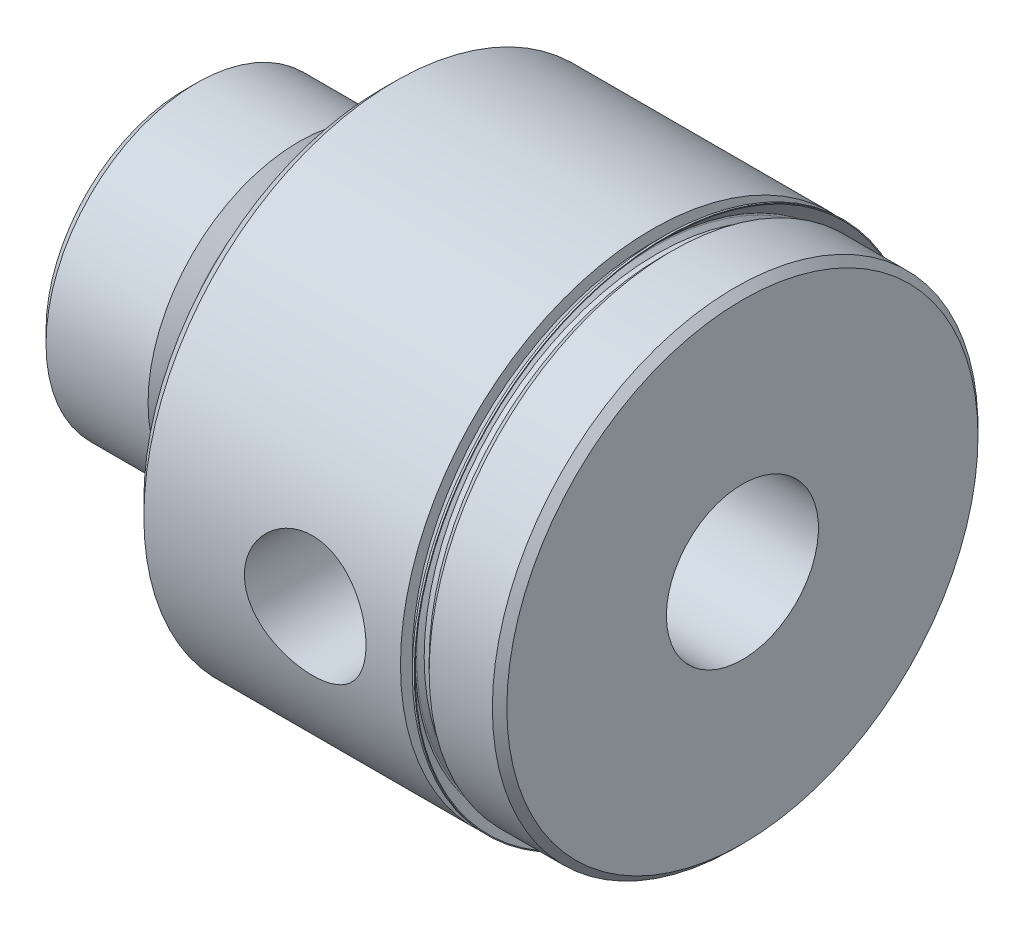
ISO-10303-21;
HEADER;
FILE_DESCRIPTION(('STEP AP214'),'2;1');
FILE_NAME('part.step','',(''),(''),'','','');
FILE_SCHEMA(('AUTOMOTIVE_DESIGN { 1 0 10303 214 1 1 1 1 }'));
ENDSEC;
DATA;
#1=APPLICATION_CONTEXT('core data for automotive mechanical design processes');
#2=APPLICATION_PROTOCOL_DEFINITION('international standard','automotive_design',2000,#1);
#3=PRODUCT_CONTEXT('',#1,'mechanical');
#4=PRODUCT('Part','Part','',(#3));
#5=PRODUCT_RELATED_PRODUCT_CATEGORY('part','',(#4));
#6=PRODUCT_DEFINITION_FORMATION('','',#4);
#7=PRODUCT_DEFINITION_CONTEXT('part definition',#1,'design');
#8=PRODUCT_DEFINITION('design','',#6,#7);
#9=PRODUCT_DEFINITION_SHAPE('','',#8);
#10=(LENGTH_UNIT() NAMED_UNIT(*) SI_UNIT(.MILLI.,.METRE.));
#11=(NAMED_UNIT(*) PLANE_ANGLE_UNIT() SI_UNIT($,.RADIAN.));
#12=(NAMED_UNIT(*) SI_UNIT($,.STERADIAN.) SOLID_ANGLE_UNIT());
#13=UNCERTAINTY_MEASURE_WITH_UNIT(LENGTH_MEASURE(1.E-05),#10,'distance_accuracy_value','');
#14=(GEOMETRIC_REPRESENTATION_CONTEXT(3) GLOBAL_UNCERTAINTY_ASSIGNED_CONTEXT((#13)) GLOBAL_UNIT_ASSIGNED_CONTEXT((#10,
#11,#12)) REPRESENTATION_CONTEXT('',''));
#15=CARTESIAN_POINT('',(0.,0.,0.));
#16=DIRECTION('',(0.,0.,1.));
#17=DIRECTION('',(1.,0.,0.));
#18=AXIS2_PLACEMENT_3D('',#15,#16,#17);
#19=CARTESIAN_POINT('',(49.1998,26.48585,0.));
#20=DIRECTION('',(-1.,0.,0.));
#21=DIRECTION('',(0.,0.,1.));
#22=AXIS2_PLACEMENT_3D('',#19,#20,#21);
#23=PLANE('',#22);
#24=CARTESIAN_POINT('',(49.1998,0.,0.));
#25=DIRECTION('',(-1.,0.,0.));
#26=DIRECTION('',(0.,0.,1.));
#27=AXIS2_PLACEMENT_3D('',#24,#25,#26);
#28=CIRCLE('',#27,26.48585);
#29=CARTESIAN_POINT('',(49.1998,0.,26.48585));
#30=VERTEX_POINT('',#29);
#31=EDGE_CURVE('E119',#30,#30,#28,.T.);
#32=ORIENTED_EDGE('',*,*,#31,.F.);
#33=EDGE_LOOP('',(#32));
#34=FACE_BOUND('',#33,.T.);
#35=CARTESIAN_POINT('',(49.1998,5.4065115745023E-13,2.56788768818364E-13));
#36=DIRECTION('',(-1.,0.,0.));
#37=DIRECTION('',(0.,0.,1.));
#38=AXIS2_PLACEMENT_3D('',#35,#36,#37);
#39=CIRCLE('',#38,25.2413407119712);
#40=CARTESIAN_POINT('',(49.1998,5.4065115745023E-13,25.2413407119715));
#41=VERTEX_POINT('',#40);
#42=EDGE_CURVE('E10',#41,#41,#39,.F.);
#43=ORIENTED_EDGE('',*,*,#42,.F.);
#44=EDGE_LOOP('',(#43));
#45=FACE_BOUND('',#44,.T.);
#46=ADVANCED_FACE('F36',(#34,#45),#23,.F.);
#47=CARTESIAN_POINT('',(58.7248,0.,0.));
#48=DIRECTION('',(-1.,0.,0.));
#49=DIRECTION('',(0.,0.,1.));
#50=AXIS2_PLACEMENT_3D('',#47,#48,#49);
#51=CYLINDRICAL_SURFACE('',#50,24.51735);
#52=CARTESIAN_POINT('',(50.2539,0.,0.));
#53=DIRECTION('',(-1.,0.,0.));
#54=DIRECTION('',(0.,0.,1.));
#55=AXIS2_PLACEMENT_3D('',#52,#53,#54);
#56=CIRCLE('',#55,24.51735);
#57=CARTESIAN_POINT('',(50.2539,0.,24.51735));
#58=VERTEX_POINT('',#57);
#59=EDGE_CURVE('E122',#58,#58,#56,.T.);
#60=ORIENTED_EDGE('',*,*,#59,.T.);
#61=EDGE_LOOP('',(#60));
#62=FACE_BOUND('',#61,.T.);
#63=CARTESIAN_POINT('',(49.7268499999997,5.32973665201552E-13,0.));
#64=DIRECTION('',(-1.,0.,0.));
#65=DIRECTION('',(0.,-1.,0.));
#66=AXIS2_PLACEMENT_3D('',#63,#64,#65);
#67=CIRCLE('',#66,24.51735);
#68=CARTESIAN_POINT('',(49.72685,-24.5173499999995,0.));
#69=VERTEX_POINT('',#68);
#70=EDGE_CURVE('E43',#69,#69,#67,.T.);
#71=ORIENTED_EDGE('',*,*,#70,.F.);
#72=EDGE_LOOP('',(#71));
#73=FACE_BOUND('',#72,.T.);
#74=ADVANCED_FACE('F109',(#62,#73),#51,.T.);
#75=CARTESIAN_POINT('',(58.7248,0.,0.));
#76=DIRECTION('',(-1.,0.,0.));
#77=DIRECTION('',(0.,0.,1.));
#78=AXIS2_PLACEMENT_3D('',#75,#76,#77);
#79=CYLINDRICAL_SURFACE('',#78,26.48585);
#80=CARTESIAN_POINT('',(22.1742,0.,0.));
#81=DIRECTION('',(-1.,0.,0.));
#82=DIRECTION('',(0.,0.,1.));
#83=AXIS2_PLACEMENT_3D('',#80,#81,#82);
#84=CIRCLE('',#83,26.48585);
#85=CARTESIAN_POINT('',(22.1742,0.,26.48585));
#86=VERTEX_POINT('',#85);
#87=EDGE_CURVE('E121',#86,#86,#84,.T.);
#88=ORIENTED_EDGE('',*,*,#87,.F.);
#89=EDGE_LOOP('',(#88));
#90=FACE_BOUND('',#89,.T.);
#91=ORIENTED_EDGE('',*,*,#31,.T.);
#92=EDGE_LOOP('',(#91));
#93=FACE_BOUND('',#92,.T.);
#94=CARTESIAN_POINT('',(34.7886221966734,-4.65327208066596,26.0738817433423));
#95=CARTESIAN_POINT('',(35.0503250137468,-4.89762199091582,26.0302748760618));
#96=CARTESIAN_POINT('',(35.3327201498537,-5.12006334865186,25.9870281951577));
#97=CARTESIAN_POINT('',(35.931400072388,-5.51501431120025,25.9060939335913));
#98=CARTESIAN_POINT('',(36.2477035296218,-5.68749621153623,25.8684094430399));
#99=CARTESIAN_POINT('',(36.9058562200807,-5.97752910885778,25.8029383750753));
#100=CARTESIAN_POINT('',(37.2477235080772,-6.09504084927617,25.7751588745996));
#101=CARTESIAN_POINT('',(37.9470384692883,-6.27117140002288,25.7328773472432));
#102=CARTESIAN_POINT('',(38.3044817703819,-6.3298066270425,25.718371619302));
#103=CARTESIAN_POINT('',(39.0179323713586,-6.38574483962577,25.7045391490489));
#104=CARTESIAN_POINT('',(39.3738495063825,-6.38413384968114,25.7049436269756));
#105=CARTESIAN_POINT('',(40.0802322089738,-6.32232180677634,25.7202154446409));
#106=CARTESIAN_POINT('',(40.4306978334773,-6.26212136614771,25.7350826332265));
#107=CARTESIAN_POINT('',(41.1131158496232,-6.08589564871848,25.7773185851145));
#108=CARTESIAN_POINT('',(41.4452053064262,-5.97037224924918,25.8045748466811));
#109=CARTESIAN_POINT('',(42.0853739137583,-5.68717401278093,25.8684608307174));
#110=CARTESIAN_POINT('',(42.393450061638,-5.51949266693799,25.9050917229558));
#111=CARTESIAN_POINT('',(42.9836495338366,-5.13268030544473,25.9845240264665));
#112=CARTESIAN_POINT('',(43.265117872442,-4.91257258253571,26.0274357486771));
#113=CARTESIAN_POINT('',(43.7875054943333,-4.42869103906106,26.1141196063505));
#114=CARTESIAN_POINT('',(44.0284199651034,-4.16491204339503,26.1578918432431));
#115=CARTESIAN_POINT('',(44.4666958604103,-3.59592222970502,26.2422080477197));
#116=CARTESIAN_POINT('',(44.6632942385423,-3.29011312197602,26.2826887486539));
#117=CARTESIAN_POINT('',(45.0019831272833,-2.64872366180494,26.3550469417978));
#118=CARTESIAN_POINT('',(45.1440799014565,-2.31314673587264,26.3869254224876));
#119=CARTESIAN_POINT('',(45.3673313362396,-1.62731201762056,26.4380101547286));
#120=CARTESIAN_POINT('',(45.4494223422459,-1.27737396757648,26.4574105151626));
#121=CARTESIAN_POINT('',(45.5534992289219,-0.568204922586495,26.4821289567605));
#122=CARTESIAN_POINT('',(45.5754959923833,-0.208975622139844,26.4874495876933));
#123=CARTESIAN_POINT('',(45.5588526593886,0.498575625977604,26.4834595581465));
#124=CARTESIAN_POINT('',(45.5217786410101,0.84693775036406,26.4745267736136));
#125=CARTESIAN_POINT('',(45.3911728201114,1.5322977583545,26.4437143091526));
#126=CARTESIAN_POINT('',(45.2976407134386,1.86929558072608,26.4218345594763));
#127=CARTESIAN_POINT('',(45.0570005679321,2.52300957468984,26.3674508746053));
#128=CARTESIAN_POINT('',(44.9098386985741,2.83970499097547,26.334936268115));
#129=CARTESIAN_POINT('',(44.5663054184986,3.44427335333977,26.2627121310261));
#130=CARTESIAN_POINT('',(44.369926407282,3.73214183811801,26.2230014894216));
#131=CARTESIAN_POINT('',(43.927487617381,4.27905807646867,26.1394061555511));
#132=CARTESIAN_POINT('',(43.680249709531,4.53714049061541,26.0954387643033));
#133=CARTESIAN_POINT('',(43.1461296484478,5.00873283077326,26.0090457210361));
#134=CARTESIAN_POINT('',(42.8592429723669,5.22223766470689,25.9666202456057));
#135=CARTESIAN_POINT('',(42.2486184115351,5.60184026829495,25.8874090176662));
#136=CARTESIAN_POINT('',(41.9243789391362,5.76715325051728,25.8507207041014));
#137=CARTESIAN_POINT('',(41.2517395999003,6.04088437052545,25.7881333535756));
#138=CARTESIAN_POINT('',(40.9033430576365,6.14931031976122,25.7622328353881));
#139=CARTESIAN_POINT('',(40.1983372701119,6.30446292347342,25.724702715276));
#140=CARTESIAN_POINT('',(39.8419571352832,6.35217440633355,25.7128455466545));
#141=CARTESIAN_POINT('',(39.1260686401128,6.38754472284827,25.7040831577162));
#142=CARTESIAN_POINT('',(38.7665606816757,6.37521116137463,25.707176043933));
#143=CARTESIAN_POINT('',(38.0620656837993,6.29176768274102,25.727721174651));
#144=CARTESIAN_POINT('',(37.716932131715,6.22181610724881,25.7448903997622));
#145=CARTESIAN_POINT('',(37.0434420700745,6.02685464231456,25.7912237896667));
#146=CARTESIAN_POINT('',(36.7150867904294,5.90184072303695,25.820388832385));
#147=CARTESIAN_POINT('',(36.0806344921371,5.59889342293915,25.8877741118627));
#148=CARTESIAN_POINT('',(35.7747997587959,5.42043137683454,25.9260839952532));
#149=CARTESIAN_POINT('',(35.1970254444508,5.01598767052723,26.0073556979387));
#150=CARTESIAN_POINT('',(34.9250911001799,4.78999868309355,26.0503182340376));
#151=CARTESIAN_POINT('',(34.4162829528898,4.29059809340729,26.1372644872056));
#152=CARTESIAN_POINT('',(34.1803669118016,4.01620947963079,26.1812488124112));
#153=CARTESIAN_POINT('',(33.757952861539,3.4310307351736,26.2643383623079));
#154=CARTESIAN_POINT('',(33.5714544483147,3.12024090214758,26.3034436268901));
#155=CARTESIAN_POINT('',(33.2539043498174,2.47148866617688,26.3722961651136));
#156=CARTESIAN_POINT('',(33.1227146368941,2.13359644089971,26.4020666862095));
#157=CARTESIAN_POINT('',(32.9194649614649,1.43965400006564,26.4489776012503));
#158=CARTESIAN_POINT('',(32.8473922411686,1.08360771988489,26.4661207201805));
#159=CARTESIAN_POINT('',(32.7660073813492,0.37383779434233,26.485526538165));
#160=CARTESIAN_POINT('',(32.7550441761507,0.0203136092254355,26.4881806614843));
#161=CARTESIAN_POINT('',(32.7918269028153,-0.683506884728561,26.4793676635885));
#162=CARTESIAN_POINT('',(32.8395744701282,-1.03380310337343,26.4679001490005));
#163=CARTESIAN_POINT('',(32.9911684446352,-1.71665918396044,26.4323453455898));
#164=CARTESIAN_POINT('',(33.094300977536,-2.04938682519429,26.4084187622674));
#165=CARTESIAN_POINT('',(33.3529302336874,-2.69274587515541,26.3505916377497));
#166=CARTESIAN_POINT('',(33.5084055046293,-3.00338627311538,26.3166951833549));
#167=CARTESIAN_POINT('',(33.8392847421248,-3.54880184234715,26.2482350378784));
#168=CARTESIAN_POINT('',(34.007862234018,-3.78787231802198,26.2145894971769));
#169=CARTESIAN_POINT('',(34.3759204274235,-4.2405681658599,26.1451769682063));
#170=CARTESIAN_POINT('',(34.5754035922491,-4.45419150737561,26.1094098109758));
#171=CARTESIAN_POINT('',(34.7886221966734,-4.65327208066596,26.0738817433423));
#172=B_SPLINE_CURVE_WITH_KNOTS('',3,(#94,#95,#96,#97,#98,#99,#100,#101,#102,#103,#104,#105,#106,
#107,#108,#109,#110,#111,#112,#113,#114,#115,#116,#117,#118,#119,#120,#121,#122,#123,#124,#125,
#126,#127,#128,#129,#130,#131,#132,#133,#134,#135,#136,#137,#138,#139,#140,#141,#142,#143,#144,
#145,#146,#147,#148,#149,#150,#151,#152,#153,#154,#155,#156,#157,#158,#159,#160,#161,#162,#163,
#164,#165,#166,#167,#168,#169,#170,#171),.UNSPECIFIED.,.T.,.F.,(4,2,2,2,2,2,2,2,2,2,2,2,2,2,2,2,
2,2,2,2,2,2,2,2,2,2,2,2,2,2,2,2,2,2,2,2,2,2,4),(0.,1.08103342167543,2.16266517603524,
3.24506819555879,4.32716932195503,5.38977358892441,6.45236675049664,7.50549783130944,
8.55876038619757,9.63343670486135,10.7082404652846,11.8003358909162,12.8923057705026,
13.9668496618744,15.0411989453702,16.087535877382,17.1338784462999,18.1812741805803,
19.2288317617372,20.3041361756732,21.3795633540412,22.4716334431099,23.5635535351669,
24.6375262803636,25.7113630074657,26.7641237764956,27.8169616065007,28.8805779590496,
29.9443584097517,31.0327737417247,32.1211801742908,33.2068540813108,34.292293631908,
35.3482590288619,36.4042538415014,37.4469532828037,38.4892259001429,39.369912094294,
40.2506685190175),.UNSPECIFIED.);
#173=CARTESIAN_POINT('',(34.7886221966734,-4.65327208066596,26.0738817433423));
#174=VERTEX_POINT('',#173);
#175=EDGE_CURVE('E47',#174,#174,#172,.T.);
#176=ORIENTED_EDGE('',*,*,#175,.F.);
#177=EDGE_LOOP('',(#176));
#178=FACE_BOUND('',#177,.T.);
#179=ADVANCED_FACE('F64',(#90,#93,#178),#79,.T.);
#180=CARTESIAN_POINT('',(0.,0.,0.));
#181=DIRECTION('',(-1.,0.,0.));
#182=DIRECTION('',(0.,0.,1.));
#183=AXIS2_PLACEMENT_3D('',#180,#181,#182);
#184=CYLINDRICAL_SURFACE('',#183,8.00735000000001);
#185=CARTESIAN_POINT('',(0.761999999999999,0.,0.));
#186=DIRECTION('',(-1.,0.,0.));
#187=DIRECTION('',(0.,0.,1.));
#188=AXIS2_PLACEMENT_3D('',#185,#186,#187);
#189=CIRCLE('',#188,8.00735000000001);
#190=CARTESIAN_POINT('',(0.761999999999999,0.,8.00735000000001));
#191=VERTEX_POINT('',#190);
#192=EDGE_CURVE('E494',#191,#191,#189,.T.);
#193=ORIENTED_EDGE('',*,*,#192,.T.);
#194=EDGE_LOOP('',(#193));
#195=FACE_BOUND('',#194,.T.);
#196=CARTESIAN_POINT('',(58.7248,0.,0.));
#197=DIRECTION('',(-1.,0.,0.));
#198=DIRECTION('',(0.,0.,1.));
#199=AXIS2_PLACEMENT_3D('',#196,#197,#198);
#200=CIRCLE('',#199,8.00735);
#201=CARTESIAN_POINT('',(58.7248,0.,8.00735));
#202=VERTEX_POINT('',#201);
#203=EDGE_CURVE('E497',#202,#202,#200,.T.);
#204=ORIENTED_EDGE('',*,*,#203,.F.);
#205=EDGE_LOOP('',(#204));
#206=FACE_BOUND('',#205,.T.);
#207=CARTESIAN_POINT('',(42.3418,0.,8.00735000000001));
#208=CARTESIAN_POINT('',(42.3417934291977,-0.170789111701739,8.00734494557788));
#209=CARTESIAN_POINT('',(42.3279407732878,-0.341865378807475,8.00182382039997));
#210=CARTESIAN_POINT('',(42.2730336672963,-0.679172399112815,7.98029426750355));
#211=CARTESIAN_POINT('',(42.2319103597272,-0.845389771674174,7.96425929382367));
#212=CARTESIAN_POINT('',(42.1241786305661,-1.16759972921024,7.92342428900425));
#213=CARTESIAN_POINT('',(42.0576511125659,-1.32362295047567,7.89865210178619));
#214=CARTESIAN_POINT('',(41.9013236076606,-1.62216374303555,7.84278864634148));
#215=CARTESIAN_POINT('',(41.8115305308494,-1.76468530731641,7.81169925497559));
#216=CARTESIAN_POINT('',(41.6068152914736,-2.03898528673037,7.74473803074991));
#217=CARTESIAN_POINT('',(41.4909908464617,-2.17005426988365,7.70871953002827));
#218=CARTESIAN_POINT('',(41.2394063016824,-2.41150385533867,7.63663616035999));
#219=CARTESIAN_POINT('',(41.1036369536651,-2.52187480582907,7.60057127763812));
#220=CARTESIAN_POINT('',(40.8088294696033,-2.72353001089667,7.530732932596));
#221=CARTESIAN_POINT('',(40.6490352872533,-2.81377323070781,7.49712775311995));
#222=CARTESIAN_POINT('',(40.3150026917458,-2.9657852362984,7.43831063979599));
#223=CARTESIAN_POINT('',(40.1407710156214,-3.02756721577263,7.41309481842663));
#224=CARTESIAN_POINT('',(39.7909604786366,-3.11804462166255,7.37548434996597));
#225=CARTESIAN_POINT('',(39.6157909200798,-3.14809712140864,7.36256638550905));
#226=CARTESIAN_POINT('',(39.2624556400958,-3.17850229347568,7.34949519355012));
#227=CARTESIAN_POINT('',(39.0842913998816,-3.17886924006476,7.34933583108766));
#228=CARTESIAN_POINT('',(38.7429730059332,-3.15092268138853,7.36135271783292));
#229=CARTESIAN_POINT('',(38.5796236056564,-3.12456272615875,7.37268874214166));
#230=CARTESIAN_POINT('',(38.2598915047937,-3.0471639646423,7.40501086698586));
#231=CARTESIAN_POINT('',(38.1035100019319,-2.99612093327468,7.42599861960832));
#232=CARTESIAN_POINT('',(37.7984196444727,-2.86983940789373,7.4757169203701));
#233=CARTESIAN_POINT('',(37.6499297662859,-2.79413270998746,7.50459539734003));
#234=CARTESIAN_POINT('',(37.367222672922,-2.62100123041283,7.56679937838561));
#235=CARTESIAN_POINT('',(37.2330107867261,-2.52356838159685,7.60012653245196));
#236=CARTESIAN_POINT('',(36.9719583159172,-2.30106244628528,7.67055197818454));
#237=CARTESIAN_POINT('',(36.8464487871171,-2.17445349720208,7.70774458175056));
#238=CARTESIAN_POINT('',(36.6180218049046,-1.90158364808727,7.77955787135076));
#239=CARTESIAN_POINT('',(36.5151086963622,-1.75531897732765,7.81417806191274));
#240=CARTESIAN_POINT('',(36.3330899525641,-1.44356878362637,7.87778614940068));
#241=CARTESIAN_POINT('',(36.2544768360916,-1.27776937722783,7.90665377646486));
#242=CARTESIAN_POINT('',(36.126714101196,-0.933864948508387,7.95459742818039));
#243=CARTESIAN_POINT('',(36.0775497849405,-0.755766114391777,7.97367833667725));
#244=CARTESIAN_POINT('',(36.0127531131586,-0.403482009388011,7.99901307240673));
#245=CARTESIAN_POINT('',(35.9953314717619,-0.229674811891061,8.00595042774256));
#246=CARTESIAN_POINT('',(35.9892418044908,0.118500756810572,8.0083636828643));
#247=CARTESIAN_POINT('',(36.0005664849199,0.292868974458038,8.00384248998512));
#248=CARTESIAN_POINT('',(36.0503257288221,0.62916095227656,7.98429468229167));
#249=CARTESIAN_POINT('',(36.0875459730532,0.791294737082631,7.96973888830865));
#250=CARTESIAN_POINT('',(36.1863951673142,1.10687135365345,7.9320717504117));
#251=CARTESIAN_POINT('',(36.2480272604357,1.26031306338113,7.90895930483082));
#252=CARTESIAN_POINT('',(36.3959577054032,1.55940434804235,7.85555247477533));
#253=CARTESIAN_POINT('',(36.4829500561873,1.70467433439668,7.82506081449788));
#254=CARTESIAN_POINT('',(36.6783597924189,1.97906216649853,7.76021112756904));
#255=CARTESIAN_POINT('',(36.7867856806772,2.10817356873655,7.72585156883598));
#256=CARTESIAN_POINT('',(37.0302400219681,2.35536477553286,7.65424947502097));
#257=CARTESIAN_POINT('',(37.1665381631049,2.47218509348462,7.61696454154625));
#258=CARTESIAN_POINT('',(37.4574743627504,2.6815961176275,7.54579099085217));
#259=CARTESIAN_POINT('',(37.6121152173856,2.77418312282537,7.51190289289606));
#260=CARTESIAN_POINT('',(37.9375177320765,2.9330079217648,7.45133832284944));
#261=CARTESIAN_POINT('',(38.1084095923326,2.99900601974877,7.42472811953139));
#262=CARTESIAN_POINT('',(38.4602518216645,3.10078839177108,7.3828079395576));
#263=CARTESIAN_POINT('',(38.6411948470921,3.13659442334504,7.36748982640094));
#264=CARTESIAN_POINT('',(38.9941807486127,3.1749149630238,7.35105184994554));
#265=CARTESIAN_POINT('',(39.1659451921561,3.17960965963316,7.34900241312962));
#266=CARTESIAN_POINT('',(39.5076900508726,3.16127955529297,7.35690592515857));
#267=CARTESIAN_POINT('',(39.6776706803493,3.13825812346457,7.36685741519331));
#268=CARTESIAN_POINT('',(40.0043818748544,3.06691841744424,7.39682795456266));
#269=CARTESIAN_POINT('',(40.1613705437429,3.0195994624794,7.41644814722414));
#270=CARTESIAN_POINT('',(40.4652466697551,2.90193514161695,7.46327107128722));
#271=CARTESIAN_POINT('',(40.6121314400455,2.83158367933025,7.49047580993093));
#272=CARTESIAN_POINT('',(40.9006848952217,2.66524885008281,7.55131495219775));
#273=CARTESIAN_POINT('',(41.0415880487164,2.56804029728916,7.58522608400396));
#274=CARTESIAN_POINT('',(41.3057759099939,2.35254898608152,7.65480072646656));
#275=CARTESIAN_POINT('',(41.4290542826015,2.23425868404682,7.69046486107564));
#276=CARTESIAN_POINT('',(41.6624922342077,1.97104279977334,7.76224113579574));
#277=CARTESIAN_POINT('',(41.7713250629183,1.82490422059654,7.7982383970318));
#278=CARTESIAN_POINT('',(41.9629079899364,1.51510515369753,7.86429503327249));
#279=CARTESIAN_POINT('',(42.0456548311691,1.35144248134648,7.89435366661017));
#280=CARTESIAN_POINT('',(42.17622450336,1.02572151534794,7.9429415283519));
#281=CARTESIAN_POINT('',(42.2264355153983,0.864731482609524,7.96223896123005));
#282=CARTESIAN_POINT('',(42.3006894791171,0.536249874348771,7.99106377184587));
#283=CARTESIAN_POINT('',(42.3248039573407,0.368777379608122,8.00061785043343));
#284=CARTESIAN_POINT('',(42.3375719366708,0.16720433152324,8.00567468361424));
#285=CARTESIAN_POINT('',(42.3391562402446,0.133789843736745,8.00630202245171));
#286=CARTESIAN_POINT('',(42.3412709454901,0.0669205805887474,8.00714018762911));
#287=CARTESIAN_POINT('',(42.3418012875363,0.0334658030550686,8.00735099040445));
#288=CARTESIAN_POINT('',(42.3418,0.,8.00735000000001));
#289=B_SPLINE_CURVE_WITH_KNOTS('',3,(#207,#208,#209,#210,#211,#212,#213,#214,#215,#216,#217,
#218,#219,#220,#221,#222,#223,#224,#225,#226,#227,#228,#229,#230,#231,#232,#233,#234,#235,#236,
#237,#238,#239,#240,#241,#242,#243,#244,#245,#246,#247,#248,#249,#250,#251,#252,#253,#254,#255,
#256,#257,#258,#259,#260,#261,#262,#263,#264,#265,#266,#267,#268,#269,#270,#271,#272,#273,#274,
#275,#276,#277,#278,#279,#280,#281,#282,#283,#284,#285,#286,#287,#288),.UNSPECIFIED.,.T.,.F.,(4,
2,2,2,2,2,2,2,2,2,2,2,2,2,2,2,2,2,2,2,2,2,2,2,2,2,2,2,2,2,2,2,2,2,2,2,2,2,2,2,4),(0.,
0.512230857607042,1.02576003088099,1.53766725002512,2.04942260175652,2.5828248538506,
3.11647522446917,3.67337498101531,4.23001631672566,4.76174447108817,5.29321694298669,
5.7884569151644,6.28378168917256,6.78911836036684,7.29464298174089,7.83850784912865,
8.3824772001822,8.93684131363264,9.49092851411198,10.012682995754,10.5343051078215,
11.0329840164664,11.5317271522487,12.0456583709088,12.5597938797569,13.1072915546179,
13.6548727964444,14.2072855275771,14.7592998283238,15.2721800401514,15.7849979135066,
16.2782377811477,16.7716083083148,17.292897887531,17.8143743741637,18.3689032907631,
18.9235014179866,19.4304921834193,19.9360898188627,20.0364548077604,20.1368254744183),.UNSPECIFIED.);
#290=CARTESIAN_POINT('',(42.3418,0.,8.00735000000001));
#291=VERTEX_POINT('',#290);
#292=EDGE_CURVE('E58',#291,#291,#289,.T.);
#293=ORIENTED_EDGE('',*,*,#292,.F.);
#294=EDGE_LOOP('',(#293));
#295=FACE_BOUND('',#294,.T.);
#296=ADVANCED_FACE('F88',(#195,#206,#295),#184,.F.);
#297=CARTESIAN_POINT('',(20.6502,0.,0.));
#298=DIRECTION('',(-1.,0.,0.));
#299=DIRECTION('',(0.,0.,1.));
#300=AXIS2_PLACEMENT_3D('',#297,#298,#299);
#301=CYLINDRICAL_SURFACE('',#300,17.44345);
#302=CARTESIAN_POINT('',(17.4752,0.,0.));
#303=DIRECTION('',(-1.,0.,0.));
#304=DIRECTION('',(0.,0.,1.));
#305=AXIS2_PLACEMENT_3D('',#302,#303,#304);
#306=CIRCLE('',#305,17.44345);
#307=CARTESIAN_POINT('',(17.4752,0.,17.44345));
#308=VERTEX_POINT('',#307);
#309=EDGE_CURVE('E51',#308,#308,#306,.T.);
#310=ORIENTED_EDGE('',*,*,#309,.F.);
#311=EDGE_LOOP('',(#310));
#312=FACE_BOUND('',#311,.T.);
#313=CARTESIAN_POINT('',(20.6502,0.,0.));
#314=DIRECTION('',(1.,0.,0.));
#315=DIRECTION('',(0.,0.,-1.));
#316=AXIS2_PLACEMENT_3D('',#313,#314,#315);
#317=CIRCLE('',#316,17.44345);
#318=CARTESIAN_POINT('',(20.6502,0.,-17.44345));
#319=VERTEX_POINT('',#318);
#320=EDGE_CURVE('E134',#319,#319,#317,.T.);
#321=ORIENTED_EDGE('',*,*,#320,.F.);
#322=EDGE_LOOP('',(#321));
#323=FACE_BOUND('',#322,.T.);
#324=ADVANCED_FACE('F38',(#312,#323),#301,.T.);
#325=CARTESIAN_POINT('',(17.4752,15.6273500000016,0.));
#326=DIRECTION('',(1.,0.,0.));
#327=DIRECTION('',(0.,0.,-1.));
#328=AXIS2_PLACEMENT_3D('',#325,#326,#327);
#329=PLANE('',#328);
#330=CARTESIAN_POINT('',(17.4752,0.,0.));
#331=DIRECTION('',(-1.,0.,0.));
#332=DIRECTION('',(0.,0.,1.));
#333=AXIS2_PLACEMENT_3D('',#330,#331,#332);
#334=CIRCLE('',#333,15.6273500000016);
#335=CARTESIAN_POINT('',(17.4752,0.,15.6273500000016));
#336=VERTEX_POINT('',#335);
#337=EDGE_CURVE('E155',#336,#336,#334,.T.);
#338=ORIENTED_EDGE('',*,*,#337,.F.);
#339=EDGE_LOOP('',(#338));
#340=FACE_BOUND('',#339,.T.);
#341=ORIENTED_EDGE('',*,*,#309,.T.);
#342=EDGE_LOOP('',(#341));
#343=FACE_BOUND('',#342,.T.);
#344=ADVANCED_FACE('F160',(#340,#343),#329,.F.);
#345=CARTESIAN_POINT('',(16.1035999999984,0.,0.));
#346=DIRECTION('',(-1.,0.,0.));
#347=DIRECTION('',(0.,0.,1.));
#348=AXIS2_PLACEMENT_3D('',#345,#346,#347);
#349=TOROIDAL_SURFACE('',#348,15.6273500000016,1.37160000000161);
#350=CARTESIAN_POINT('',(16.1035999999984,0.,0.));
#351=DIRECTION('',(-1.,0.,0.));
#352=DIRECTION('',(0.,0.,1.));
#353=AXIS2_PLACEMENT_3D('',#350,#351,#352);
#354=CIRCLE('',#353,14.25575);
#355=CARTESIAN_POINT('',(16.1035999999984,0.,14.25575));
#356=VERTEX_POINT('',#355);
#357=EDGE_CURVE('E152',#356,#356,#354,.T.);
#358=ORIENTED_EDGE('',*,*,#357,.F.);
#359=EDGE_LOOP('',(#358));
#360=FACE_BOUND('',#359,.T.);
#361=ORIENTED_EDGE('',*,*,#337,.T.);
#362=EDGE_LOOP('',(#361));
#363=FACE_BOUND('',#362,.T.);
#364=ADVANCED_FACE('F198',(#360,#363),#349,.F.);
#365=CARTESIAN_POINT('',(20.6502,0.,0.));
#366=DIRECTION('',(-1.,0.,0.));
#367=DIRECTION('',(0.,0.,1.));
#368=AXIS2_PLACEMENT_3D('',#365,#366,#367);
#369=CYLINDRICAL_SURFACE('',#368,14.25575);
#370=CARTESIAN_POINT('',(14.2366999999989,0.,0.));
#371=DIRECTION('',(-1.,0.,0.));
#372=DIRECTION('',(0.,0.,1.));
#373=AXIS2_PLACEMENT_3D('',#370,#371,#372);
#374=CIRCLE('',#373,14.25575);
#375=CARTESIAN_POINT('',(14.2366999999989,0.,14.25575));
#376=VERTEX_POINT('',#375);
#377=EDGE_CURVE('E149',#376,#376,#374,.T.);
#378=ORIENTED_EDGE('',*,*,#377,.F.);
#379=EDGE_LOOP('',(#378));
#380=FACE_BOUND('',#379,.T.);
#381=ORIENTED_EDGE('',*,*,#357,.T.);
#382=EDGE_LOOP('',(#381));
#383=FACE_BOUND('',#382,.T.);
#384=ADVANCED_FACE('F194',(#380,#383),#369,.T.);
#385=CARTESIAN_POINT('',(14.2366999999989,0.,0.));
#386=DIRECTION('',(-1.,0.,0.));
#387=DIRECTION('',(0.,0.,1.));
#388=AXIS2_PLACEMENT_3D('',#385,#386,#387);
#389=TOROIDAL_SURFACE('',#388,15.6273499999983,1.37159999999829);
#390=CARTESIAN_POINT('',(13.2834291470902,0.,0.));
#391=DIRECTION('',(-1.,0.,0.));
#392=DIRECTION('',(0.,0.,1.));
#393=AXIS2_PLACEMENT_3D('',#390,#391,#392);
#394=CIRCLE('',#393,14.6411648039068);
#395=CARTESIAN_POINT('',(13.2834291470902,0.,14.6411648039068));
#396=VERTEX_POINT('',#395);
#397=EDGE_CURVE('E146',#396,#396,#394,.T.);
#398=ORIENTED_EDGE('',*,*,#397,.F.);
#399=EDGE_LOOP('',(#398));
#400=FACE_BOUND('',#399,.T.);
#401=ORIENTED_EDGE('',*,*,#377,.T.);
#402=EDGE_LOOP('',(#401));
#403=FACE_BOUND('',#402,.T.);
#404=ADVANCED_FACE('F190',(#400,#403),#389,.F.);
#405=CARTESIAN_POINT('',(13.2834291470902,0.,0.));
#406=DIRECTION('',(-1.,0.,0.));
#407=DIRECTION('',(0.,0.,1.));
#408=AXIS2_PLACEMENT_3D('',#405,#406,#407);
#409=CONICAL_SURFACE('',#408,14.6411648039068,0.768428877685793);
#410=CARTESIAN_POINT('',(12.006992338925,0.,0.));
#411=DIRECTION('',(-1.,0.,0.));
#412=DIRECTION('',(0.,0.,1.));
#413=AXIS2_PLACEMENT_3D('',#410,#411,#412);
#414=CIRCLE('',#413,15.875);
#415=CARTESIAN_POINT('',(12.006992338925,0.,15.875));
#416=VERTEX_POINT('',#415);
#417=EDGE_CURVE('E143',#416,#416,#414,.T.);
#418=ORIENTED_EDGE('',*,*,#417,.F.);
#419=EDGE_LOOP('',(#418));
#420=FACE_BOUND('',#419,.T.);
#421=ORIENTED_EDGE('',*,*,#397,.T.);
#422=EDGE_LOOP('',(#421));
#423=FACE_BOUND('',#422,.T.);
#424=ADVANCED_FACE('F186',(#420,#423),#409,.T.);
#425=CARTESIAN_POINT('',(20.6502,0.,0.));
#426=DIRECTION('',(-1.,0.,0.));
#427=DIRECTION('',(0.,0.,1.));
#428=AXIS2_PLACEMENT_3D('',#425,#426,#427);
#429=CYLINDRICAL_SURFACE('',#428,15.875);
#430=CARTESIAN_POINT('',(1.25984,0.,0.));
#431=DIRECTION('',(-1.,0.,0.));
#432=DIRECTION('',(0.,0.,1.));
#433=AXIS2_PLACEMENT_3D('',#430,#431,#432);
#434=CIRCLE('',#433,15.875);
#435=CARTESIAN_POINT('',(1.25984,0.,15.875));
#436=VERTEX_POINT('',#435);
#437=EDGE_CURVE('E140',#436,#436,#434,.T.);
#438=ORIENTED_EDGE('',*,*,#437,.F.);
#439=EDGE_LOOP('',(#438));
#440=FACE_BOUND('',#439,.T.);
#441=ORIENTED_EDGE('',*,*,#417,.T.);
#442=EDGE_LOOP('',(#441));
#443=FACE_BOUND('',#442,.T.);
#444=ADVANCED_FACE('F182',(#440,#443),#429,.T.);
#445=CARTESIAN_POINT('',(1.25984,0.,0.));
#446=DIRECTION('',(1.,0.,0.));
#447=DIRECTION('',(0.,0.,-1.));
#448=AXIS2_PLACEMENT_3D('',#445,#446,#447);
#449=CONICAL_SURFACE('',#448,15.875,0.785398163397448);
#450=CARTESIAN_POINT('',(0.,0.,0.));
#451=DIRECTION('',(-1.,0.,0.));
#452=DIRECTION('',(0.,0.,1.));
#453=AXIS2_PLACEMENT_3D('',#450,#451,#452);
#454=CIRCLE('',#453,14.61516);
#455=CARTESIAN_POINT('',(0.,0.,14.61516));
#456=VERTEX_POINT('',#455);
#457=EDGE_CURVE('E137',#456,#456,#454,.T.);
#458=ORIENTED_EDGE('',*,*,#457,.F.);
#459=EDGE_LOOP('',(#458));
#460=FACE_BOUND('',#459,.T.);
#461=ORIENTED_EDGE('',*,*,#437,.T.);
#462=EDGE_LOOP('',(#461));
#463=FACE_BOUND('',#462,.T.);
#464=ADVANCED_FACE('F176',(#460,#463),#449,.T.);
#465=CARTESIAN_POINT('',(0.,0.,0.));
#466=DIRECTION('',(1.,0.,0.));
#467=DIRECTION('',(0.,0.,-1.));
#468=AXIS2_PLACEMENT_3D('',#465,#466,#467);
#469=PLANE('',#468);
#470=CARTESIAN_POINT('',(0.,0.,0.));
#471=DIRECTION('',(-1.,0.,0.));
#472=DIRECTION('',(0.,0.,1.));
#473=AXIS2_PLACEMENT_3D('',#470,#471,#472);
#474=CIRCLE('',#473,8.76935);
#475=CARTESIAN_POINT('',(0.,0.,8.76935));
#476=VERTEX_POINT('',#475);
#477=EDGE_CURVE('E491',#476,#476,#474,.T.);
#478=ORIENTED_EDGE('',*,*,#477,.F.);
#479=EDGE_LOOP('',(#478));
#480=FACE_BOUND('',#479,.T.);
#481=ORIENTED_EDGE('',*,*,#457,.T.);
#482=EDGE_LOOP('',(#481));
#483=FACE_BOUND('',#482,.T.);
#484=ADVANCED_FACE('F168',(#480,#483),#469,.F.);
#485=CARTESIAN_POINT('',(20.6502,0.,0.));
#486=DIRECTION('',(1.,0.,0.));
#487=DIRECTION('',(0.,0.,-1.));
#488=AXIS2_PLACEMENT_3D('',#485,#486,#487);
#489=PLANE('',#488);
#490=CARTESIAN_POINT('',(20.6502,0.,0.));
#491=DIRECTION('',(-1.,0.,0.));
#492=DIRECTION('',(0.,0.,1.));
#493=AXIS2_PLACEMENT_3D('',#490,#491,#492);
#494=CIRCLE('',#493,24.96185);
#495=CARTESIAN_POINT('',(20.6502,0.,24.96185));
#496=VERTEX_POINT('',#495);
#497=EDGE_CURVE('E125',#496,#496,#494,.T.);
#498=ORIENTED_EDGE('',*,*,#497,.T.);
#499=EDGE_LOOP('',(#498));
#500=FACE_BOUND('',#499,.T.);
#501=ORIENTED_EDGE('',*,*,#320,.T.);
#502=EDGE_LOOP('',(#501));
#503=FACE_BOUND('',#502,.T.);
#504=ADVANCED_FACE('F166',(#500,#503),#489,.F.);
#505=CARTESIAN_POINT('',(22.1742,0.,0.));
#506=DIRECTION('',(1.,0.,0.));
#507=DIRECTION('',(0.,0.,-1.));
#508=AXIS2_PLACEMENT_3D('',#505,#506,#507);
#509=CONICAL_SURFACE('',#508,26.48585,0.78539816339745);
#510=ORIENTED_EDGE('',*,*,#497,.F.);
#511=EDGE_LOOP('',(#510));
#512=FACE_BOUND('',#511,.T.);
#513=ORIENTED_EDGE('',*,*,#87,.T.);
#514=EDGE_LOOP('',(#513));
#515=FACE_BOUND('',#514,.T.);
#516=ADVANCED_FACE('F107',(#512,#515),#509,.T.);
#517=CARTESIAN_POINT('',(51.308,0.,0.));
#518=DIRECTION('',(1.,0.,0.));
#519=DIRECTION('',(0.,0.,-1.));
#520=AXIS2_PLACEMENT_3D('',#517,#518,#519);
#521=CONICAL_SURFACE('',#520,25.57145,0.78539816339745);
#522=ORIENTED_EDGE('',*,*,#59,.F.);
#523=EDGE_LOOP('',(#522));
#524=FACE_BOUND('',#523,.T.);
#525=CARTESIAN_POINT('',(51.308,0.,0.));
#526=DIRECTION('',(-1.,0.,0.));
#527=DIRECTION('',(0.,0.,1.));
#528=AXIS2_PLACEMENT_3D('',#525,#526,#527);
#529=CIRCLE('',#528,25.57145);
#530=CARTESIAN_POINT('',(51.308,0.,25.57145));
#531=VERTEX_POINT('',#530);
#532=EDGE_CURVE('E128',#531,#531,#529,.T.);
#533=ORIENTED_EDGE('',*,*,#532,.T.);
#534=EDGE_LOOP('',(#533));
#535=FACE_BOUND('',#534,.T.);
#536=ADVANCED_FACE('F103',(#524,#535),#521,.T.);
#537=CARTESIAN_POINT('',(58.7248,0.,0.));
#538=DIRECTION('',(-1.,0.,0.));
#539=DIRECTION('',(0.,0.,1.));
#540=AXIS2_PLACEMENT_3D('',#537,#538,#539);
#541=CYLINDRICAL_SURFACE('',#540,25.57145);
#542=ORIENTED_EDGE('',*,*,#532,.F.);
#543=EDGE_LOOP('',(#542));
#544=FACE_BOUND('',#543,.T.);
#545=CARTESIAN_POINT('',(57.9628,0.,0.));
#546=DIRECTION('',(-1.,0.,0.));
#547=DIRECTION('',(0.,0.,1.));
#548=AXIS2_PLACEMENT_3D('',#545,#546,#547);
#549=CIRCLE('',#548,25.57145);
#550=CARTESIAN_POINT('',(57.9628,0.,25.57145));
#551=VERTEX_POINT('',#550);
#552=EDGE_CURVE('E503',#551,#551,#549,.T.);
#553=ORIENTED_EDGE('',*,*,#552,.T.);
#554=EDGE_LOOP('',(#553));
#555=FACE_BOUND('',#554,.T.);
#556=ADVANCED_FACE('F99',(#544,#555),#541,.T.);
#557=CARTESIAN_POINT('',(58.7248,0.,0.));
#558=DIRECTION('',(-1.,0.,0.));
#559=DIRECTION('',(0.,0.,1.));
#560=AXIS2_PLACEMENT_3D('',#557,#558,#559);
#561=CONICAL_SURFACE('',#560,24.80945,0.785398163397448);
#562=ORIENTED_EDGE('',*,*,#552,.F.);
#563=EDGE_LOOP('',(#562));
#564=FACE_BOUND('',#563,.T.);
#565=CARTESIAN_POINT('',(58.7248,0.,0.));
#566=DIRECTION('',(-1.,0.,0.));
#567=DIRECTION('',(0.,0.,1.));
#568=AXIS2_PLACEMENT_3D('',#565,#566,#567);
#569=CIRCLE('',#568,24.80945);
#570=CARTESIAN_POINT('',(58.7248,0.,24.80945));
#571=VERTEX_POINT('',#570);
#572=EDGE_CURVE('E500',#571,#571,#569,.T.);
#573=ORIENTED_EDGE('',*,*,#572,.T.);
#574=EDGE_LOOP('',(#573));
#575=FACE_BOUND('',#574,.T.);
#576=ADVANCED_FACE('F95',(#564,#575),#561,.T.);
#577=CARTESIAN_POINT('',(58.7248,24.80945,0.));
#578=DIRECTION('',(-1.,0.,0.));
#579=DIRECTION('',(0.,0.,1.));
#580=AXIS2_PLACEMENT_3D('',#577,#578,#579);
#581=PLANE('',#580);
#582=ORIENTED_EDGE('',*,*,#203,.T.);
#583=EDGE_LOOP('',(#582));
#584=FACE_BOUND('',#583,.T.);
#585=ORIENTED_EDGE('',*,*,#572,.F.);
#586=EDGE_LOOP('',(#585));
#587=FACE_BOUND('',#586,.T.);
#588=ADVANCED_FACE('F86',(#584,#587),#581,.F.);
#589=CARTESIAN_POINT('',(0.,0.,0.));
#590=DIRECTION('',(-1.,0.,0.));
#591=DIRECTION('',(0.,0.,1.));
#592=AXIS2_PLACEMENT_3D('',#589,#590,#591);
#593=CONICAL_SURFACE('',#592,8.76935,0.785398163397444);
#594=ORIENTED_EDGE('',*,*,#192,.F.);
#595=EDGE_LOOP('',(#594));
#596=FACE_BOUND('',#595,.T.);
#597=ORIENTED_EDGE('',*,*,#477,.T.);
#598=EDGE_LOOP('',(#597));
#599=FACE_BOUND('',#598,.T.);
#600=ADVANCED_FACE('F74',(#596,#599),#593,.F.);
#601=CARTESIAN_POINT('',(39.1668,0.,26.48585));
#602=DIRECTION('',(0.,0.,1.));
#603=DIRECTION('',(1.,0.,0.));
#604=AXIS2_PLACEMENT_3D('',#601,#602,#603);
#605=CONICAL_SURFACE('',#604,6.402022745908,0.0312094049979284);
#606=CARTESIAN_POINT('',(39.1668,0.,11.75385));
#607=DIRECTION('',(0.,0.,-1.));
#608=DIRECTION('',(-1.,0.,0.));
#609=AXIS2_PLACEMENT_3D('',#606,#607,#608);
#610=CIRCLE('',#609,5.942096454912);
#611=CARTESIAN_POINT('',(33.224703545088,0.,11.75385));
#612=VERTEX_POINT('',#611);
#613=EDGE_CURVE('E485',#612,#612,#610,.T.);
#614=ORIENTED_EDGE('',*,*,#613,.T.);
#615=EDGE_LOOP('',(#614));
#616=FACE_BOUND('',#615,.T.);
#617=ORIENTED_EDGE('',*,*,#175,.T.);
#618=EDGE_LOOP('',(#617));
#619=FACE_BOUND('',#618,.T.);
#620=ADVANCED_FACE('F68',(#616,#619),#605,.F.);
#621=CARTESIAN_POINT('',(39.1668,0.,26.48585));
#622=DIRECTION('',(0.,0.,-1.));
#623=DIRECTION('',(-1.,0.,0.));
#624=AXIS2_PLACEMENT_3D('',#621,#622,#623);
#625=CYLINDRICAL_SURFACE('',#624,3.175);
#626=CARTESIAN_POINT('',(39.1668,0.,8.9867535450887));
#627=DIRECTION('',(0.,0.,-1.));
#628=DIRECTION('',(-1.,0.,0.));
#629=AXIS2_PLACEMENT_3D('',#626,#627,#628);
#630=CIRCLE('',#629,3.175);
#631=CARTESIAN_POINT('',(35.9918,0.,8.9867535450887));
#632=VERTEX_POINT('',#631);
#633=EDGE_CURVE('E488',#632,#632,#630,.T.);
#634=ORIENTED_EDGE('',*,*,#633,.F.);
#635=EDGE_LOOP('',(#634));
#636=FACE_BOUND('',#635,.T.);
#637=ORIENTED_EDGE('',*,*,#292,.T.);
#638=EDGE_LOOP('',(#637));
#639=FACE_BOUND('',#638,.T.);
#640=ADVANCED_FACE('F73',(#636,#639),#625,.F.);
#641=CARTESIAN_POINT('',(39.1668,0.,11.75385));
#642=DIRECTION('',(0.,0.,1.));
#643=DIRECTION('',(1.,0.,0.));
#644=AXIS2_PLACEMENT_3D('',#641,#642,#643);
#645=CONICAL_SURFACE('',#644,5.942096454912,0.785398163397575);
#646=ORIENTED_EDGE('',*,*,#633,.T.);
#647=EDGE_LOOP('',(#646));
#648=FACE_BOUND('',#647,.T.);
#649=ORIENTED_EDGE('',*,*,#613,.F.);
#650=EDGE_LOOP('',(#649));
#651=FACE_BOUND('',#650,.T.);
#652=ADVANCED_FACE('F78',(#648,#651),#645,.F.);
#653=CARTESIAN_POINT('',(50.4443092880283,5.4065115745023E-13,0.));
#654=DIRECTION('',(1.,0.,0.));
#655=DIRECTION('',(0.,1.,0.));
#656=AXIS2_PLACEMENT_3D('',#653,#654,#655);
#657=CONICAL_SURFACE('',#656,26.4858499999995,0.785398163397436);
#658=ORIENTED_EDGE('',*,*,#42,.T.);
#659=EDGE_LOOP('',(#658));
#660=FACE_BOUND('',#659,.T.);
#661=CARTESIAN_POINT('',(50.4443092880283,5.4065115745023E-13,0.));
#662=DIRECTION('',(-1.,0.,0.));
#663=DIRECTION('',(0.,-1.,0.));
#664=AXIS2_PLACEMENT_3D('',#661,#662,#663);
#665=CIRCLE('',#664,26.4858499999995);
#666=CARTESIAN_POINT('',(50.4443092880286,-26.4858499999989,0.));
#667=VERTEX_POINT('',#666);
#668=EDGE_CURVE('E476',#667,#667,#665,.T.);
#669=ORIENTED_EDGE('',*,*,#668,.T.);
#670=EDGE_LOOP('',(#669));
#671=FACE_BOUND('',#670,.T.);
#672=ADVANCED_FACE('F76',(#660,#671),#657,.T.);
#673=CARTESIAN_POINT('',(50.2539,5.3861359816665E-13,0.));
#674=DIRECTION('',(-1.,0.,0.));
#675=DIRECTION('',(0.,-1.,0.));
#676=AXIS2_PLACEMENT_3D('',#673,#674,#675);
#677=CYLINDRICAL_SURFACE('',#676,26.4858499999995);
#678=ORIENTED_EDGE('',*,*,#668,.F.);
#679=EDGE_LOOP('',(#678));
#680=FACE_BOUND('',#679,.T.);
#681=CARTESIAN_POINT('',(50.6475092880283,5.42825589436773E-13,0.));
#682=DIRECTION('',(-1.,0.,0.));
#683=DIRECTION('',(0.,-1.,0.));
#684=AXIS2_PLACEMENT_3D('',#681,#682,#683);
#685=CIRCLE('',#684,26.4858499999995);
#686=CARTESIAN_POINT('',(50.6475092880286,-26.4858499999989,0.));
#687=VERTEX_POINT('',#686);
#688=EDGE_CURVE('E470',#687,#687,#685,.T.);
#689=ORIENTED_EDGE('',*,*,#688,.T.);
#690=EDGE_LOOP('',(#689));
#691=FACE_BOUND('',#690,.T.);
#692=ADVANCED_FACE('F256',(#680,#691),#677,.T.);
#693=CARTESIAN_POINT('',(50.6475092880282,26.4016818041255,0.));
#694=DIRECTION('',(-1.,0.,0.));
#695=DIRECTION('',(0.,-1.,0.));
#696=AXIS2_PLACEMENT_3D('',#693,#694,#695);
#697=PLANE('',#696);
#698=ORIENTED_EDGE('',*,*,#688,.F.);
#699=EDGE_LOOP('',(#698));
#700=FACE_BOUND('',#699,.T.);
#701=CARTESIAN_POINT('',(50.6475092880288,5.42825589436778E-13,0.));
#702=DIRECTION('',(-1.,0.,0.));
#703=DIRECTION('',(0.,-1.,0.));
#704=AXIS2_PLACEMENT_3D('',#701,#702,#703);
#705=CIRCLE('',#704,26.401681804125);
#706=CARTESIAN_POINT('',(50.6475092880291,-26.4016818041244,0.));
#707=VERTEX_POINT('',#706);
#708=EDGE_CURVE('E473',#707,#707,#705,.T.);
#709=ORIENTED_EDGE('',*,*,#708,.T.);
#710=EDGE_LOOP('',(#709));
#711=FACE_BOUND('',#710,.T.);
#712=ADVANCED_FACE('F261',(#700,#711),#697,.F.);
#713=CARTESIAN_POINT('',(49.3348163031623,5.28778534245814E-13,0.));
#714=DIRECTION('',(1.,0.,0.));
#715=DIRECTION('',(0.,1.,0.));
#716=AXIS2_PLACEMENT_3D('',#713,#714,#715);
#717=CONICAL_SURFACE('',#716,25.0889888192585,0.785398163397439);
#718=ORIENTED_EDGE('',*,*,#708,.F.);
#719=EDGE_LOOP('',(#718));
#720=FACE_BOUND('',#719,.T.);
#721=CARTESIAN_POINT('',(49.3348163031623,5.28778534245814E-13,0.));
#722=DIRECTION('',(-1.,0.,0.));
#723=DIRECTION('',(0.,-1.,0.));
#724=AXIS2_PLACEMENT_3D('',#721,#722,#723);
#725=CIRCLE('',#724,25.0889888192585);
#726=CARTESIAN_POINT('',(49.3348163031625,-25.0889888192579,0.));
#727=VERTEX_POINT('',#726);
#728=EDGE_CURVE('E474',#727,#727,#725,.T.);
#729=ORIENTED_EDGE('',*,*,#728,.T.);
#730=EDGE_LOOP('',(#729));
#731=FACE_BOUND('',#730,.T.);
#732=ADVANCED_FACE('F281',(#720,#731),#717,.F.);
#733=CARTESIAN_POINT('',(49.4246188643736,5.27355936696949E-13,0.));
#734=DIRECTION('',(-1.,0.,0.));
#735=DIRECTION('',(0.,-1.,0.));
#736=AXIS2_PLACEMENT_3D('',#733,#734,#735);
#737=TOROIDAL_SURFACE('',#736,24.999186258048,0.127000000000285);
#738=ORIENTED_EDGE('',*,*,#728,.F.);
#739=EDGE_LOOP('',(#738));
#740=FACE_BOUND('',#739,.T.);
#741=CARTESIAN_POINT('',(49.3348163031623,5.28778534245814E-13,0.));
#742=DIRECTION('',(-1.,0.,0.));
#743=DIRECTION('',(0.,-1.,0.));
#744=AXIS2_PLACEMENT_3D('',#741,#742,#743);
#745=CIRCLE('',#744,24.9093836968375);
#746=CARTESIAN_POINT('',(49.3348163031625,-24.9093836968369,0.));
#747=VERTEX_POINT('',#746);
#748=EDGE_CURVE('E479',#747,#747,#745,.T.);
#749=ORIENTED_EDGE('',*,*,#748,.T.);
#750=EDGE_LOOP('',(#749));
#751=FACE_BOUND('',#750,.T.);
#752=ADVANCED_FACE('F286',(#740,#751),#737,.F.);
#753=CARTESIAN_POINT('',(49.7268500000003,5.32973665201558E-13,0.));
#754=DIRECTION('',(-1.,0.,0.));
#755=DIRECTION('',(0.,-1.,0.));
#756=AXIS2_PLACEMENT_3D('',#753,#754,#755);
#757=CONICAL_SURFACE('',#756,24.5173499999995,0.785398163397453);
#758=ORIENTED_EDGE('',*,*,#748,.F.);
#759=EDGE_LOOP('',(#758));
#760=FACE_BOUND('',#759,.T.);
#761=ORIENTED_EDGE('',*,*,#70,.T.);
#762=EDGE_LOOP('',(#761));
#763=FACE_BOUND('',#762,.T.);
#764=ADVANCED_FACE('F314',(#760,#763),#757,.T.);
#765=CLOSED_SHELL('',(#46,#74,#179,#296,#324,#344,#364,#384,#404,#424,#444,#464,#484,#504,#516,
#536,#556,#576,#588,#600,#620,#640,#652,#672,#692,#712,#732,#752,#764));
#766=MANIFOLD_SOLID_BREP('B2',#765);
#767=ADVANCED_BREP_SHAPE_REPRESENTATION('',(#18,#766),#14);
#768=SHAPE_DEFINITION_REPRESENTATION(#9,#767);
ENDSEC;
END-ISO-10303-21;
